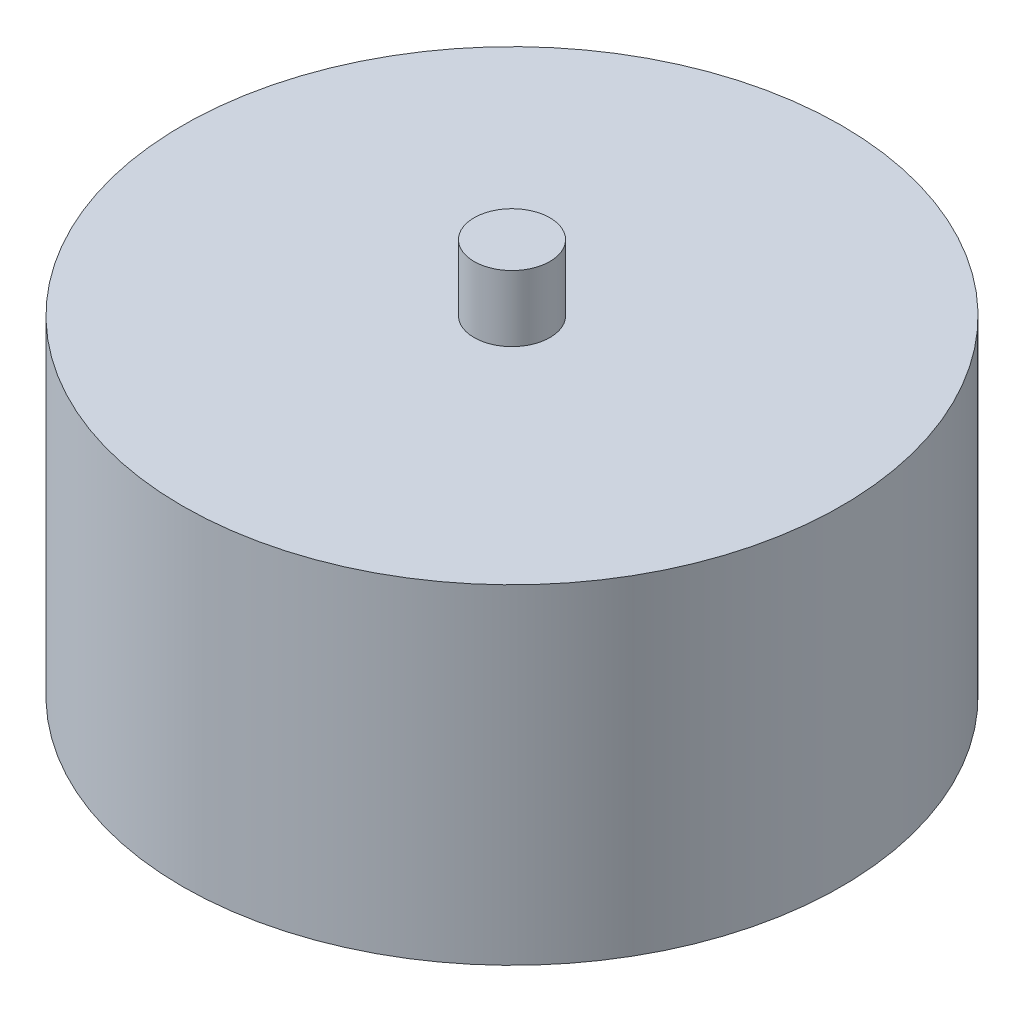
ISO-10303-21;
HEADER;
FILE_DESCRIPTION(('STEP AP214'),'2;1');
FILE_NAME('part.step','',(''),(''),'','','');
FILE_SCHEMA(('AUTOMOTIVE_DESIGN { 1 0 10303 214 1 1 1 1 }'));
ENDSEC;
DATA;
#1=APPLICATION_CONTEXT('core data for automotive mechanical design processes');
#2=APPLICATION_PROTOCOL_DEFINITION('international standard','automotive_design',2000,#1);
#3=PRODUCT_CONTEXT('',#1,'mechanical');
#4=PRODUCT('Part','Part','',(#3));
#5=PRODUCT_RELATED_PRODUCT_CATEGORY('part','',(#4));
#6=PRODUCT_DEFINITION_FORMATION('','',#4);
#7=PRODUCT_DEFINITION_CONTEXT('part definition',#1,'design');
#8=PRODUCT_DEFINITION('design','',#6,#7);
#9=PRODUCT_DEFINITION_SHAPE('','',#8);
#10=(LENGTH_UNIT() NAMED_UNIT(*) SI_UNIT(.MILLI.,.METRE.));
#11=(NAMED_UNIT(*) PLANE_ANGLE_UNIT() SI_UNIT($,.RADIAN.));
#12=(NAMED_UNIT(*) SI_UNIT($,.STERADIAN.) SOLID_ANGLE_UNIT());
#13=UNCERTAINTY_MEASURE_WITH_UNIT(LENGTH_MEASURE(1.E-05),#10,'distance_accuracy_value','');
#14=(GEOMETRIC_REPRESENTATION_CONTEXT(3) GLOBAL_UNCERTAINTY_ASSIGNED_CONTEXT((#13)) GLOBAL_UNIT_ASSIGNED_CONTEXT((#10,
#11,#12)) REPRESENTATION_CONTEXT('',''));
#15=CARTESIAN_POINT('',(0.,0.,0.));
#16=DIRECTION('',(0.,0.,1.));
#17=DIRECTION('',(1.,0.,0.));
#18=AXIS2_PLACEMENT_3D('',#15,#16,#17);
#19=CARTESIAN_POINT('',(0.,-10.,0.));
#20=DIRECTION('',(0.,1.,0.));
#21=DIRECTION('',(0.,0.,1.));
#22=AXIS2_PLACEMENT_3D('',#19,#20,#21);
#23=CYLINDRICAL_SURFACE('',#22,10.);
#24=CARTESIAN_POINT('',(0.,-10.,0.));
#25=DIRECTION('',(0.,1.,0.));
#26=DIRECTION('',(0.,0.,1.));
#27=AXIS2_PLACEMENT_3D('',#24,#25,#26);
#28=CIRCLE('',#27,10.);
#29=CARTESIAN_POINT('',(0.,-10.,10.));
#30=VERTEX_POINT('',#29);
#31=EDGE_CURVE('E10',#30,#30,#28,.T.);
#32=ORIENTED_EDGE('',*,*,#31,.T.);
#33=EDGE_LOOP('',(#32));
#34=FACE_BOUND('',#33,.T.);
#35=CARTESIAN_POINT('',(0.,0.,0.));
#36=DIRECTION('',(0.,1.,0.));
#37=DIRECTION('',(0.,0.,1.));
#38=AXIS2_PLACEMENT_3D('',#35,#36,#37);
#39=CIRCLE('',#38,10.);
#40=CARTESIAN_POINT('',(0.,0.,10.));
#41=VERTEX_POINT('',#40);
#42=EDGE_CURVE('E34',#41,#41,#39,.T.);
#43=ORIENTED_EDGE('',*,*,#42,.F.);
#44=EDGE_LOOP('',(#43));
#45=FACE_BOUND('',#44,.T.);
#46=ADVANCED_FACE('F31',(#34,#45),#23,.T.);
#47=CARTESIAN_POINT('',(0.,-10.,0.));
#48=DIRECTION('',(0.,1.,0.));
#49=DIRECTION('',(0.,0.,1.));
#50=AXIS2_PLACEMENT_3D('',#47,#48,#49);
#51=PLANE('',#50);
#52=CARTESIAN_POINT('',(6.49519052838374,-10.,3.74999999999974));
#53=DIRECTION('',(0.,1.,0.));
#54=DIRECTION('',(0.,0.,1.));
#55=AXIS2_PLACEMENT_3D('',#52,#53,#54);
#56=CIRCLE('',#55,1.5);
#57=CARTESIAN_POINT('',(6.49519052838374,-10.,5.24999999999974));
#58=VERTEX_POINT('',#57);
#59=EDGE_CURVE('E61',#58,#58,#56,.T.);
#60=ORIENTED_EDGE('',*,*,#59,.T.);
#61=EDGE_LOOP('',(#60));
#62=FACE_BOUND('',#61,.T.);
#63=CARTESIAN_POINT('',(-6.49519052838284,-10.,3.75000000000026));
#64=DIRECTION('',(0.,1.,0.));
#65=DIRECTION('',(0.,0.,1.));
#66=AXIS2_PLACEMENT_3D('',#63,#64,#65);
#67=CIRCLE('',#66,1.5);
#68=CARTESIAN_POINT('',(-6.49519052838284,-10.,5.25000000000026));
#69=VERTEX_POINT('',#68);
#70=EDGE_CURVE('E58',#69,#69,#67,.T.);
#71=ORIENTED_EDGE('',*,*,#70,.T.);
#72=EDGE_LOOP('',(#71));
#73=FACE_BOUND('',#72,.T.);
#74=CARTESIAN_POINT('',(0.,-10.,-7.5));
#75=DIRECTION('',(0.,1.,0.));
#76=DIRECTION('',(0.,0.,1.));
#77=AXIS2_PLACEMENT_3D('',#74,#75,#76);
#78=CIRCLE('',#77,1.5);
#79=CARTESIAN_POINT('',(0.,-10.,-6.));
#80=VERTEX_POINT('',#79);
#81=EDGE_CURVE('E52',#80,#80,#78,.T.);
#82=ORIENTED_EDGE('',*,*,#81,.T.);
#83=EDGE_LOOP('',(#82));
#84=FACE_BOUND('',#83,.T.);
#85=ORIENTED_EDGE('',*,*,#31,.F.);
#86=EDGE_LOOP('',(#85));
#87=FACE_BOUND('',#86,.T.);
#88=ADVANCED_FACE('F79',(#62,#73,#84,#87),#51,.F.);
#89=CARTESIAN_POINT('',(0.,0.,0.));
#90=DIRECTION('',(0.,1.,0.));
#91=DIRECTION('',(0.,0.,1.));
#92=AXIS2_PLACEMENT_3D('',#89,#90,#91);
#93=PLANE('',#92);
#94=CARTESIAN_POINT('',(0.,0.,0.));
#95=DIRECTION('',(0.,1.,0.));
#96=DIRECTION('',(0.,0.,1.));
#97=AXIS2_PLACEMENT_3D('',#94,#95,#96);
#98=CIRCLE('',#97,1.15);
#99=CARTESIAN_POINT('',(0.,0.,1.15));
#100=VERTEX_POINT('',#99);
#101=EDGE_CURVE('E43',#100,#100,#98,.T.);
#102=ORIENTED_EDGE('',*,*,#101,.F.);
#103=EDGE_LOOP('',(#102));
#104=FACE_BOUND('',#103,.T.);
#105=ORIENTED_EDGE('',*,*,#42,.T.);
#106=EDGE_LOOP('',(#105));
#107=FACE_BOUND('',#106,.T.);
#108=ADVANCED_FACE('F83',(#104,#107),#93,.T.);
#109=CARTESIAN_POINT('',(0.,2.,0.));
#110=DIRECTION('',(0.,-1.,0.));
#111=DIRECTION('',(0.,0.,-1.));
#112=AXIS2_PLACEMENT_3D('',#109,#110,#111);
#113=CYLINDRICAL_SURFACE('',#112,1.15);
#114=CARTESIAN_POINT('',(0.,2.,0.));
#115=DIRECTION('',(0.,1.,0.));
#116=DIRECTION('',(0.,0.,1.));
#117=AXIS2_PLACEMENT_3D('',#114,#115,#116);
#118=CIRCLE('',#117,1.15);
#119=CARTESIAN_POINT('',(0.,2.,1.15));
#120=VERTEX_POINT('',#119);
#121=EDGE_CURVE('E41',#120,#120,#118,.T.);
#122=ORIENTED_EDGE('',*,*,#121,.F.);
#123=EDGE_LOOP('',(#122));
#124=FACE_BOUND('',#123,.T.);
#125=ORIENTED_EDGE('',*,*,#101,.T.);
#126=EDGE_LOOP('',(#125));
#127=FACE_BOUND('',#126,.T.);
#128=ADVANCED_FACE('F90',(#124,#127),#113,.T.);
#129=CARTESIAN_POINT('',(0.,2.,0.));
#130=DIRECTION('',(0.,1.,0.));
#131=DIRECTION('',(0.,0.,1.));
#132=AXIS2_PLACEMENT_3D('',#129,#130,#131);
#133=PLANE('',#132);
#134=ORIENTED_EDGE('',*,*,#121,.T.);
#135=EDGE_LOOP('',(#134));
#136=FACE_BOUND('',#135,.T.);
#137=ADVANCED_FACE('F95',(#136),#133,.T.);
#138=CARTESIAN_POINT('',(0.,-5.,-7.5));
#139=DIRECTION('',(0.,-1.,0.));
#140=DIRECTION('',(0.,0.,-1.));
#141=AXIS2_PLACEMENT_3D('',#138,#139,#140);
#142=CYLINDRICAL_SURFACE('',#141,1.5);
#143=CARTESIAN_POINT('',(0.,-5.,-7.5));
#144=DIRECTION('',(0.,1.,0.));
#145=DIRECTION('',(0.,0.,1.));
#146=AXIS2_PLACEMENT_3D('',#143,#144,#145);
#147=CIRCLE('',#146,1.5);
#148=CARTESIAN_POINT('',(0.,-5.,-6.));
#149=VERTEX_POINT('',#148);
#150=EDGE_CURVE('E49',#149,#149,#147,.T.);
#151=ORIENTED_EDGE('',*,*,#150,.T.);
#152=EDGE_LOOP('',(#151));
#153=FACE_BOUND('',#152,.T.);
#154=ORIENTED_EDGE('',*,*,#81,.F.);
#155=EDGE_LOOP('',(#154));
#156=FACE_BOUND('',#155,.T.);
#157=ADVANCED_FACE('F102',(#153,#156),#142,.F.);
#158=CARTESIAN_POINT('',(0.,-5.,-7.5));
#159=DIRECTION('',(0.,1.,0.));
#160=DIRECTION('',(0.,0.,1.));
#161=AXIS2_PLACEMENT_3D('',#158,#159,#160);
#162=PLANE('',#161);
#163=ORIENTED_EDGE('',*,*,#150,.F.);
#164=EDGE_LOOP('',(#163));
#165=FACE_BOUND('',#164,.T.);
#166=ADVANCED_FACE('F104',(#165),#162,.F.);
#167=CARTESIAN_POINT('',(-6.49519052838284,-5.,3.75000000000026));
#168=DIRECTION('',(0.,-1.,0.));
#169=DIRECTION('',(0.,0.,-1.));
#170=AXIS2_PLACEMENT_3D('',#167,#168,#169);
#171=CYLINDRICAL_SURFACE('',#170,1.5);
#172=CARTESIAN_POINT('',(-6.49519052838284,-5.,3.75000000000026));
#173=DIRECTION('',(0.,1.,0.));
#174=DIRECTION('',(0.,0.,1.));
#175=AXIS2_PLACEMENT_3D('',#172,#173,#174);
#176=CIRCLE('',#175,1.5);
#177=CARTESIAN_POINT('',(-6.49519052838284,-5.,5.25000000000026));
#178=VERTEX_POINT('',#177);
#179=EDGE_CURVE('E55',#178,#178,#176,.T.);
#180=ORIENTED_EDGE('',*,*,#179,.T.);
#181=EDGE_LOOP('',(#180));
#182=FACE_BOUND('',#181,.T.);
#183=ORIENTED_EDGE('',*,*,#70,.F.);
#184=EDGE_LOOP('',(#183));
#185=FACE_BOUND('',#184,.T.);
#186=ADVANCED_FACE('F107',(#182,#185),#171,.F.);
#187=CARTESIAN_POINT('',(-6.49519052838284,-5.,3.75000000000026));
#188=DIRECTION('',(0.,1.,0.));
#189=DIRECTION('',(0.,0.,1.));
#190=AXIS2_PLACEMENT_3D('',#187,#188,#189);
#191=PLANE('',#190);
#192=ORIENTED_EDGE('',*,*,#179,.F.);
#193=EDGE_LOOP('',(#192));
#194=FACE_BOUND('',#193,.T.);
#195=ADVANCED_FACE('F76',(#194),#191,.F.);
#196=CARTESIAN_POINT('',(6.49519052838374,-5.,3.74999999999974));
#197=DIRECTION('',(0.,-1.,0.));
#198=DIRECTION('',(0.,0.,-1.));
#199=AXIS2_PLACEMENT_3D('',#196,#197,#198);
#200=CYLINDRICAL_SURFACE('',#199,1.5);
#201=CARTESIAN_POINT('',(6.49519052838374,-5.,3.74999999999974));
#202=DIRECTION('',(0.,1.,0.));
#203=DIRECTION('',(0.,0.,1.));
#204=AXIS2_PLACEMENT_3D('',#201,#202,#203);
#205=CIRCLE('',#204,1.5);
#206=CARTESIAN_POINT('',(6.49519052838374,-5.,5.24999999999974));
#207=VERTEX_POINT('',#206);
#208=EDGE_CURVE('E46',#207,#207,#205,.T.);
#209=ORIENTED_EDGE('',*,*,#208,.T.);
#210=EDGE_LOOP('',(#209));
#211=FACE_BOUND('',#210,.T.);
#212=ORIENTED_EDGE('',*,*,#59,.F.);
#213=EDGE_LOOP('',(#212));
#214=FACE_BOUND('',#213,.T.);
#215=ADVANCED_FACE('F67',(#211,#214),#200,.F.);
#216=CARTESIAN_POINT('',(6.49519052838374,-5.,3.74999999999974));
#217=DIRECTION('',(0.,1.,0.));
#218=DIRECTION('',(0.,0.,1.));
#219=AXIS2_PLACEMENT_3D('',#216,#217,#218);
#220=PLANE('',#219);
#221=ORIENTED_EDGE('',*,*,#208,.F.);
#222=EDGE_LOOP('',(#221));
#223=FACE_BOUND('',#222,.T.);
#224=ADVANCED_FACE('F70',(#223),#220,.F.);
#225=CLOSED_SHELL('',(#46,#88,#108,#128,#137,#157,#166,#186,#195,#215,#224));
#226=MANIFOLD_SOLID_BREP('B2',#225);
#227=ADVANCED_BREP_SHAPE_REPRESENTATION('',(#18,#226),#14);
#228=SHAPE_DEFINITION_REPRESENTATION(#9,#227);
ENDSEC;
END-ISO-10303-21;
